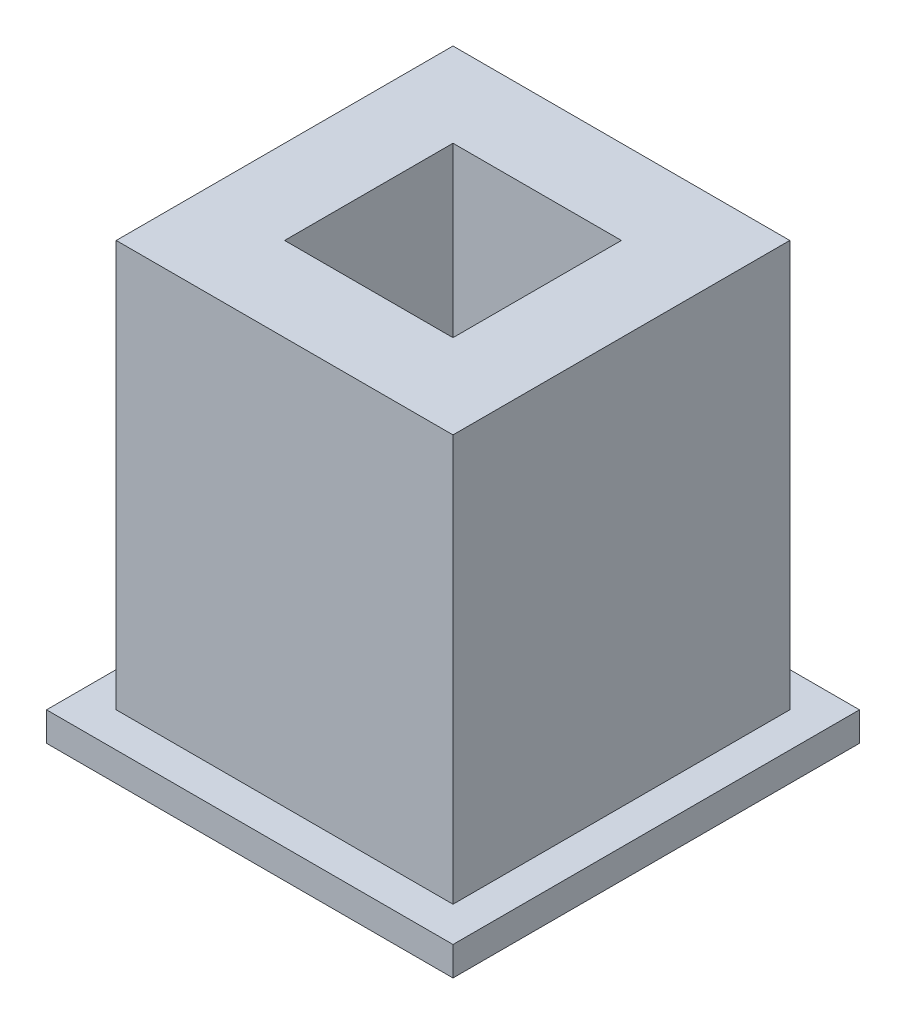
ISO-10303-21;
HEADER;
FILE_DESCRIPTION(('STEP AP214'),'2;1');
FILE_NAME('part.step','',(''),(''),'','','');
FILE_SCHEMA(('AUTOMOTIVE_DESIGN { 1 0 10303 214 1 1 1 1 }'));
ENDSEC;
DATA;
#1=APPLICATION_CONTEXT('core data for automotive mechanical design processes');
#2=APPLICATION_PROTOCOL_DEFINITION('international standard','automotive_design',2000,#1);
#3=PRODUCT_CONTEXT('',#1,'mechanical');
#4=PRODUCT('Part','Part','',(#3));
#5=PRODUCT_RELATED_PRODUCT_CATEGORY('part','',(#4));
#6=PRODUCT_DEFINITION_FORMATION('','',#4);
#7=PRODUCT_DEFINITION_CONTEXT('part definition',#1,'design');
#8=PRODUCT_DEFINITION('design','',#6,#7);
#9=PRODUCT_DEFINITION_SHAPE('','',#8);
#10=(LENGTH_UNIT() NAMED_UNIT(*) SI_UNIT(.MILLI.,.METRE.));
#11=(NAMED_UNIT(*) PLANE_ANGLE_UNIT() SI_UNIT($,.RADIAN.));
#12=(NAMED_UNIT(*) SI_UNIT($,.STERADIAN.) SOLID_ANGLE_UNIT());
#13=UNCERTAINTY_MEASURE_WITH_UNIT(LENGTH_MEASURE(1.E-05),#10,'distance_accuracy_value','');
#14=(GEOMETRIC_REPRESENTATION_CONTEXT(3) GLOBAL_UNCERTAINTY_ASSIGNED_CONTEXT((#13)) GLOBAL_UNIT_ASSIGNED_CONTEXT((#10,
#11,#12)) REPRESENTATION_CONTEXT('',''));
#15=CARTESIAN_POINT('',(0.,0.,0.));
#16=DIRECTION('',(0.,0.,1.));
#17=DIRECTION('',(1.,0.,0.));
#18=AXIS2_PLACEMENT_3D('',#15,#16,#17);
#19=CARTESIAN_POINT('',(0.,7.,0.));
#20=DIRECTION('',(1.,0.,0.));
#21=DIRECTION('',(0.,0.,-1.));
#22=AXIS2_PLACEMENT_3D('',#19,#20,#21);
#23=PLANE('',#22);
#24=DIRECTION('',(0.,0.,1.));
#25=VECTOR('',#24,1.);
#26=CARTESIAN_POINT('',(0.,0.,0.));
#27=LINE('',#26,#25);
#28=CARTESIAN_POINT('',(0.,0.,-5.8));
#29=VERTEX_POINT('',#28);
#30=CARTESIAN_POINT('',(0.,0.,0.));
#31=VERTEX_POINT('',#30);
#32=EDGE_CURVE('E230',#29,#31,#27,.T.);
#33=ORIENTED_EDGE('',*,*,#32,.T.);
#34=DIRECTION('',(0.,-1.,0.));
#35=VECTOR('',#34,1.);
#36=CARTESIAN_POINT('',(0.,7.,0.));
#37=LINE('',#36,#35);
#38=CARTESIAN_POINT('',(0.,7.,0.));
#39=VERTEX_POINT('',#38);
#40=EDGE_CURVE('E280',#39,#31,#37,.T.);
#41=ORIENTED_EDGE('',*,*,#40,.F.);
#42=DIRECTION('',(0.,0.,1.));
#43=VECTOR('',#42,1.);
#44=CARTESIAN_POINT('',(0.,7.,0.));
#45=LINE('',#44,#43);
#46=CARTESIAN_POINT('',(0.,7.,-5.8));
#47=VERTEX_POINT('',#46);
#48=EDGE_CURVE('E240',#47,#39,#45,.T.);
#49=ORIENTED_EDGE('',*,*,#48,.F.);
#50=DIRECTION('',(0.,-1.,0.));
#51=VECTOR('',#50,1.);
#52=CARTESIAN_POINT('',(0.,7.,-5.8));
#53=LINE('',#52,#51);
#54=EDGE_CURVE('E254',#47,#29,#53,.T.);
#55=ORIENTED_EDGE('',*,*,#54,.T.);
#56=EDGE_LOOP('',(#33,#41,#49,#55));
#57=FACE_BOUND('',#56,.T.);
#58=ADVANCED_FACE('F47',(#57),#23,.F.);
#59=CARTESIAN_POINT('',(0.,7.,0.));
#60=DIRECTION('',(0.,0.,-1.));
#61=DIRECTION('',(-1.,0.,0.));
#62=AXIS2_PLACEMENT_3D('',#59,#60,#61);
#63=PLANE('',#62);
#64=DIRECTION('',(1.,0.,0.));
#65=VECTOR('',#64,1.);
#66=CARTESIAN_POINT('',(0.,0.,0.));
#67=LINE('',#66,#65);
#68=CARTESIAN_POINT('',(5.8,0.,0.));
#69=VERTEX_POINT('',#68);
#70=EDGE_CURVE('E258',#31,#69,#67,.T.);
#71=ORIENTED_EDGE('',*,*,#70,.T.);
#72=DIRECTION('',(0.,-1.,0.));
#73=VECTOR('',#72,1.);
#74=CARTESIAN_POINT('',(5.8,7.,0.));
#75=LINE('',#74,#73);
#76=CARTESIAN_POINT('',(5.8,7.,0.));
#77=VERTEX_POINT('',#76);
#78=EDGE_CURVE('E276',#77,#69,#75,.T.);
#79=ORIENTED_EDGE('',*,*,#78,.F.);
#80=DIRECTION('',(1.,0.,0.));
#81=VECTOR('',#80,1.);
#82=CARTESIAN_POINT('',(0.,7.,0.));
#83=LINE('',#82,#81);
#84=EDGE_CURVE('E244',#39,#77,#83,.T.);
#85=ORIENTED_EDGE('',*,*,#84,.F.);
#86=ORIENTED_EDGE('',*,*,#40,.T.);
#87=EDGE_LOOP('',(#71,#79,#85,#86));
#88=FACE_BOUND('',#87,.T.);
#89=ADVANCED_FACE('F338',(#88),#63,.F.);
#90=CARTESIAN_POINT('',(5.8,7.,0.));
#91=DIRECTION('',(-1.,0.,0.));
#92=DIRECTION('',(0.,0.,1.));
#93=AXIS2_PLACEMENT_3D('',#90,#91,#92);
#94=PLANE('',#93);
#95=DIRECTION('',(0.,0.,-1.));
#96=VECTOR('',#95,1.);
#97=CARTESIAN_POINT('',(5.8,0.,0.));
#98=LINE('',#97,#96);
#99=CARTESIAN_POINT('',(5.8,0.,-5.8));
#100=VERTEX_POINT('',#99);
#101=EDGE_CURVE('E262',#69,#100,#98,.T.);
#102=ORIENTED_EDGE('',*,*,#101,.T.);
#103=DIRECTION('',(0.,-1.,0.));
#104=VECTOR('',#103,1.);
#105=CARTESIAN_POINT('',(5.8,7.,-5.8));
#106=LINE('',#105,#104);
#107=CARTESIAN_POINT('',(5.8,7.,-5.8));
#108=VERTEX_POINT('',#107);
#109=EDGE_CURVE('E272',#108,#100,#106,.T.);
#110=ORIENTED_EDGE('',*,*,#109,.F.);
#111=DIRECTION('',(0.,0.,-1.));
#112=VECTOR('',#111,1.);
#113=CARTESIAN_POINT('',(5.8,7.,0.));
#114=LINE('',#113,#112);
#115=EDGE_CURVE('E248',#77,#108,#114,.T.);
#116=ORIENTED_EDGE('',*,*,#115,.F.);
#117=ORIENTED_EDGE('',*,*,#78,.T.);
#118=EDGE_LOOP('',(#102,#110,#116,#117));
#119=FACE_BOUND('',#118,.T.);
#120=ADVANCED_FACE('F345',(#119),#94,.F.);
#121=CARTESIAN_POINT('',(0.,7.,-5.8));
#122=DIRECTION('',(0.,0.,1.));
#123=DIRECTION('',(1.,0.,0.));
#124=AXIS2_PLACEMENT_3D('',#121,#122,#123);
#125=PLANE('',#124);
#126=DIRECTION('',(-1.,0.,0.));
#127=VECTOR('',#126,1.);
#128=CARTESIAN_POINT('',(0.,0.,-5.8));
#129=LINE('',#128,#127);
#130=EDGE_CURVE('E245',#100,#29,#129,.T.);
#131=ORIENTED_EDGE('',*,*,#130,.T.);
#132=ORIENTED_EDGE('',*,*,#54,.F.);
#133=DIRECTION('',(-1.,0.,0.));
#134=VECTOR('',#133,1.);
#135=CARTESIAN_POINT('',(0.,7.,-5.8));
#136=LINE('',#135,#134);
#137=EDGE_CURVE('E251',#108,#47,#136,.T.);
#138=ORIENTED_EDGE('',*,*,#137,.F.);
#139=ORIENTED_EDGE('',*,*,#109,.T.);
#140=EDGE_LOOP('',(#131,#132,#138,#139));
#141=FACE_BOUND('',#140,.T.);
#142=ADVANCED_FACE('F382',(#141),#125,.F.);
#143=CARTESIAN_POINT('',(0.,7.,0.));
#144=DIRECTION('',(0.,-1.,0.));
#145=DIRECTION('',(0.,0.,-1.));
#146=AXIS2_PLACEMENT_3D('',#143,#144,#145);
#147=PLANE('',#146);
#148=DIRECTION('',(1.,0.,0.));
#149=VECTOR('',#148,1.);
#150=CARTESIAN_POINT('',(1.45,7.,-1.45));
#151=LINE('',#150,#149);
#152=CARTESIAN_POINT('',(1.45,7.,-1.45));
#153=VERTEX_POINT('',#152);
#154=CARTESIAN_POINT('',(4.35,7.,-1.45));
#155=VERTEX_POINT('',#154);
#156=EDGE_CURVE('E216',#153,#155,#151,.T.);
#157=ORIENTED_EDGE('',*,*,#156,.F.);
#158=DIRECTION('',(0.,0.,1.));
#159=VECTOR('',#158,1.);
#160=CARTESIAN_POINT('',(1.45,7.,-4.35));
#161=LINE('',#160,#159);
#162=CARTESIAN_POINT('',(1.45,7.,-4.35));
#163=VERTEX_POINT('',#162);
#164=EDGE_CURVE('E162',#163,#153,#161,.T.);
#165=ORIENTED_EDGE('',*,*,#164,.F.);
#166=DIRECTION('',(-1.,0.,0.));
#167=VECTOR('',#166,1.);
#168=CARTESIAN_POINT('',(1.45,7.,-4.35));
#169=LINE('',#168,#167);
#170=CARTESIAN_POINT('',(4.35,7.,-4.35));
#171=VERTEX_POINT('',#170);
#172=EDGE_CURVE('E201',#171,#163,#169,.T.);
#173=ORIENTED_EDGE('',*,*,#172,.F.);
#174=DIRECTION('',(0.,0.,-1.));
#175=VECTOR('',#174,1.);
#176=CARTESIAN_POINT('',(4.35,7.,-4.35));
#177=LINE('',#176,#175);
#178=EDGE_CURVE('E220',#155,#171,#177,.T.);
#179=ORIENTED_EDGE('',*,*,#178,.F.);
#180=EDGE_LOOP('',(#157,#165,#173,#179));
#181=FACE_BOUND('',#180,.T.);
#182=ORIENTED_EDGE('',*,*,#48,.T.);
#183=ORIENTED_EDGE('',*,*,#84,.T.);
#184=ORIENTED_EDGE('',*,*,#115,.T.);
#185=ORIENTED_EDGE('',*,*,#137,.T.);
#186=EDGE_LOOP('',(#182,#183,#184,#185));
#187=FACE_BOUND('',#186,.T.);
#188=ADVANCED_FACE('F387',(#181,#187),#147,.F.);
#189=CARTESIAN_POINT('',(1.45,3.2,-4.35));
#190=DIRECTION('',(-1.,0.,0.));
#191=DIRECTION('',(0.,0.,1.));
#192=AXIS2_PLACEMENT_3D('',#189,#190,#191);
#193=PLANE('',#192);
#194=ORIENTED_EDGE('',*,*,#164,.T.);
#195=DIRECTION('',(0.,1.,0.));
#196=VECTOR('',#195,1.);
#197=CARTESIAN_POINT('',(1.45,3.2,-1.45));
#198=LINE('',#197,#196);
#199=CARTESIAN_POINT('',(1.45,3.2,-1.45));
#200=VERTEX_POINT('',#199);
#201=EDGE_CURVE('E213',#200,#153,#198,.T.);
#202=ORIENTED_EDGE('',*,*,#201,.F.);
#203=DIRECTION('',(0.,0.,1.));
#204=VECTOR('',#203,1.);
#205=CARTESIAN_POINT('',(1.45,3.2,-4.35));
#206=LINE('',#205,#204);
#207=CARTESIAN_POINT('',(1.45,3.2,-4.35));
#208=VERTEX_POINT('',#207);
#209=EDGE_CURVE('E196',#208,#200,#206,.T.);
#210=ORIENTED_EDGE('',*,*,#209,.F.);
#211=DIRECTION('',(0.,1.,0.));
#212=VECTOR('',#211,1.);
#213=CARTESIAN_POINT('',(1.45,3.2,-4.35));
#214=LINE('',#213,#212);
#215=EDGE_CURVE('E227',#208,#163,#214,.T.);
#216=ORIENTED_EDGE('',*,*,#215,.T.);
#217=EDGE_LOOP('',(#194,#202,#210,#216));
#218=FACE_BOUND('',#217,.T.);
#219=ADVANCED_FACE('F398',(#218),#193,.F.);
#220=CARTESIAN_POINT('',(1.45,3.2,-4.35));
#221=DIRECTION('',(0.,0.,-1.));
#222=DIRECTION('',(-1.,0.,0.));
#223=AXIS2_PLACEMENT_3D('',#220,#221,#222);
#224=PLANE('',#223);
#225=ORIENTED_EDGE('',*,*,#172,.T.);
#226=ORIENTED_EDGE('',*,*,#215,.F.);
#227=DIRECTION('',(-1.,0.,0.));
#228=VECTOR('',#227,1.);
#229=CARTESIAN_POINT('',(1.45,3.2,-4.35));
#230=LINE('',#229,#228);
#231=CARTESIAN_POINT('',(4.35,3.2,-4.35));
#232=VERTEX_POINT('',#231);
#233=EDGE_CURVE('E209',#232,#208,#230,.T.);
#234=ORIENTED_EDGE('',*,*,#233,.F.);
#235=DIRECTION('',(0.,1.,0.));
#236=VECTOR('',#235,1.);
#237=CARTESIAN_POINT('',(4.35,3.2,-4.35));
#238=LINE('',#237,#236);
#239=EDGE_CURVE('E231',#232,#171,#238,.T.);
#240=ORIENTED_EDGE('',*,*,#239,.T.);
#241=EDGE_LOOP('',(#225,#226,#234,#240));
#242=FACE_BOUND('',#241,.T.);
#243=ADVANCED_FACE('F402',(#242),#224,.F.);
#244=CARTESIAN_POINT('',(4.35,3.2,-4.35));
#245=DIRECTION('',(1.,0.,0.));
#246=DIRECTION('',(0.,0.,-1.));
#247=AXIS2_PLACEMENT_3D('',#244,#245,#246);
#248=PLANE('',#247);
#249=ORIENTED_EDGE('',*,*,#178,.T.);
#250=ORIENTED_EDGE('',*,*,#239,.F.);
#251=DIRECTION('',(0.,0.,-1.));
#252=VECTOR('',#251,1.);
#253=CARTESIAN_POINT('',(4.35,3.2,-4.35));
#254=LINE('',#253,#252);
#255=CARTESIAN_POINT('',(4.35,3.2,-1.45));
#256=VERTEX_POINT('',#255);
#257=EDGE_CURVE('E205',#256,#232,#254,.T.);
#258=ORIENTED_EDGE('',*,*,#257,.F.);
#259=DIRECTION('',(0.,1.,0.));
#260=VECTOR('',#259,1.);
#261=CARTESIAN_POINT('',(4.35,3.2,-1.45));
#262=LINE('',#261,#260);
#263=EDGE_CURVE('E234',#256,#155,#262,.T.);
#264=ORIENTED_EDGE('',*,*,#263,.T.);
#265=EDGE_LOOP('',(#249,#250,#258,#264));
#266=FACE_BOUND('',#265,.T.);
#267=ADVANCED_FACE('F408',(#266),#248,.F.);
#268=CARTESIAN_POINT('',(1.45,3.2,-1.45));
#269=DIRECTION('',(0.,0.,1.));
#270=DIRECTION('',(1.,0.,0.));
#271=AXIS2_PLACEMENT_3D('',#268,#269,#270);
#272=PLANE('',#271);
#273=ORIENTED_EDGE('',*,*,#156,.T.);
#274=ORIENTED_EDGE('',*,*,#263,.F.);
#275=DIRECTION('',(1.,0.,0.));
#276=VECTOR('',#275,1.);
#277=CARTESIAN_POINT('',(1.45,3.2,-1.45));
#278=LINE('',#277,#276);
#279=EDGE_CURVE('E200',#200,#256,#278,.T.);
#280=ORIENTED_EDGE('',*,*,#279,.F.);
#281=ORIENTED_EDGE('',*,*,#201,.T.);
#282=EDGE_LOOP('',(#273,#274,#280,#281));
#283=FACE_BOUND('',#282,.T.);
#284=ADVANCED_FACE('F404',(#283),#272,.F.);
#285=CARTESIAN_POINT('',(0.,3.2,0.));
#286=DIRECTION('',(0.,1.,0.));
#287=DIRECTION('',(0.,0.,1.));
#288=AXIS2_PLACEMENT_3D('',#285,#286,#287);
#289=PLANE('',#288);
#290=ORIENTED_EDGE('',*,*,#209,.T.);
#291=ORIENTED_EDGE('',*,*,#279,.T.);
#292=ORIENTED_EDGE('',*,*,#257,.T.);
#293=ORIENTED_EDGE('',*,*,#233,.T.);
#294=EDGE_LOOP('',(#290,#291,#292,#293));
#295=FACE_BOUND('',#294,.T.);
#296=ADVANCED_FACE('F407',(#295),#289,.T.);
#297=CARTESIAN_POINT('',(-0.6,-1.7,0.6));
#298=DIRECTION('',(1.,0.,0.));
#299=DIRECTION('',(0.,0.,-1.));
#300=AXIS2_PLACEMENT_3D('',#297,#298,#299);
#301=PLANE('',#300);
#302=DIRECTION('',(0.,1.,0.));
#303=VECTOR('',#302,1.);
#304=CARTESIAN_POINT('',(-0.6,-1.7,-6.4));
#305=LINE('',#304,#303);
#306=CARTESIAN_POINT('',(-0.6,-0.499999999999997,-6.4));
#307=VERTEX_POINT('',#306);
#308=CARTESIAN_POINT('',(-0.6,0.,-6.4));
#309=VERTEX_POINT('',#308);
#310=EDGE_CURVE('E151',#307,#309,#305,.T.);
#311=ORIENTED_EDGE('',*,*,#310,.F.);
#312=DIRECTION('',(0.,0.,1.));
#313=VECTOR('',#312,1.);
#314=CARTESIAN_POINT('',(-0.6,-0.499999999999997,0.6));
#315=LINE('',#314,#313);
#316=CARTESIAN_POINT('',(-0.6,-0.499999999999997,0.6));
#317=VERTEX_POINT('',#316);
#318=EDGE_CURVE('E297',#307,#317,#315,.T.);
#319=ORIENTED_EDGE('',*,*,#318,.T.);
#320=DIRECTION('',(0.,1.,0.));
#321=VECTOR('',#320,1.);
#322=CARTESIAN_POINT('',(-0.6,-1.7,0.6));
#323=LINE('',#322,#321);
#324=CARTESIAN_POINT('',(-0.6,0.,0.6));
#325=VERTEX_POINT('',#324);
#326=EDGE_CURVE('E175',#317,#325,#323,.T.);
#327=ORIENTED_EDGE('',*,*,#326,.T.);
#328=DIRECTION('',(0.,0.,-1.));
#329=VECTOR('',#328,1.);
#330=CARTESIAN_POINT('',(-0.6,0.,0.6));
#331=LINE('',#330,#329);
#332=EDGE_CURVE('E169',#325,#309,#331,.T.);
#333=ORIENTED_EDGE('',*,*,#332,.T.);
#334=EDGE_LOOP('',(#311,#319,#327,#333));
#335=FACE_BOUND('',#334,.T.);
#336=ADVANCED_FACE('F174',(#335),#301,.F.);
#337=CARTESIAN_POINT('',(-0.6,-1.7,-6.4));
#338=DIRECTION('',(0.,0.,1.));
#339=DIRECTION('',(1.,0.,0.));
#340=AXIS2_PLACEMENT_3D('',#337,#338,#339);
#341=PLANE('',#340);
#342=DIRECTION('',(0.,1.,0.));
#343=VECTOR('',#342,1.);
#344=CARTESIAN_POINT('',(6.4,-1.7,-6.4));
#345=LINE('',#344,#343);
#346=CARTESIAN_POINT('',(6.4,-0.499999999999997,-6.4));
#347=VERTEX_POINT('',#346);
#348=CARTESIAN_POINT('',(6.4,0.,-6.4));
#349=VERTEX_POINT('',#348);
#350=EDGE_CURVE('E163',#347,#349,#345,.T.);
#351=ORIENTED_EDGE('',*,*,#350,.F.);
#352=DIRECTION('',(-1.,0.,0.));
#353=VECTOR('',#352,1.);
#354=CARTESIAN_POINT('',(-0.6,-0.499999999999997,-6.4));
#355=LINE('',#354,#353);
#356=EDGE_CURVE('E11',#347,#307,#355,.T.);
#357=ORIENTED_EDGE('',*,*,#356,.T.);
#358=ORIENTED_EDGE('',*,*,#310,.T.);
#359=DIRECTION('',(1.,0.,0.));
#360=VECTOR('',#359,1.);
#361=CARTESIAN_POINT('',(-0.6,0.,-6.4));
#362=LINE('',#361,#360);
#363=EDGE_CURVE('E154',#309,#349,#362,.T.);
#364=ORIENTED_EDGE('',*,*,#363,.T.);
#365=EDGE_LOOP('',(#351,#357,#358,#364));
#366=FACE_BOUND('',#365,.T.);
#367=ADVANCED_FACE('F153',(#366),#341,.F.);
#368=CARTESIAN_POINT('',(6.4,-1.7,0.6));
#369=DIRECTION('',(-1.,0.,0.));
#370=DIRECTION('',(0.,0.,1.));
#371=AXIS2_PLACEMENT_3D('',#368,#369,#370);
#372=PLANE('',#371);
#373=DIRECTION('',(0.,1.,0.));
#374=VECTOR('',#373,1.);
#375=CARTESIAN_POINT('',(6.4,-1.7,0.6));
#376=LINE('',#375,#374);
#377=CARTESIAN_POINT('',(6.4,-0.499999999999997,0.6));
#378=VERTEX_POINT('',#377);
#379=CARTESIAN_POINT('',(6.4,0.,0.6));
#380=VERTEX_POINT('',#379);
#381=EDGE_CURVE('E191',#378,#380,#376,.T.);
#382=ORIENTED_EDGE('',*,*,#381,.F.);
#383=DIRECTION('',(0.,0.,-1.));
#384=VECTOR('',#383,1.);
#385=CARTESIAN_POINT('',(6.4,-0.499999999999997,-6.4));
#386=LINE('',#385,#384);
#387=EDGE_CURVE('E58',#378,#347,#386,.T.);
#388=ORIENTED_EDGE('',*,*,#387,.T.);
#389=ORIENTED_EDGE('',*,*,#350,.T.);
#390=DIRECTION('',(0.,0.,1.));
#391=VECTOR('',#390,1.);
#392=CARTESIAN_POINT('',(6.4,0.,0.6));
#393=LINE('',#392,#391);
#394=EDGE_CURVE('E171',#349,#380,#393,.T.);
#395=ORIENTED_EDGE('',*,*,#394,.T.);
#396=EDGE_LOOP('',(#382,#388,#389,#395));
#397=FACE_BOUND('',#396,.T.);
#398=ADVANCED_FACE('F328',(#397),#372,.F.);
#399=CARTESIAN_POINT('',(-0.6,-1.7,0.6));
#400=DIRECTION('',(0.,0.,-1.));
#401=DIRECTION('',(-1.,0.,0.));
#402=AXIS2_PLACEMENT_3D('',#399,#400,#401);
#403=PLANE('',#402);
#404=ORIENTED_EDGE('',*,*,#326,.F.);
#405=DIRECTION('',(1.,0.,0.));
#406=VECTOR('',#405,1.);
#407=CARTESIAN_POINT('',(6.4,-0.499999999999997,0.6));
#408=LINE('',#407,#406);
#409=EDGE_CURVE('E73',#317,#378,#408,.T.);
#410=ORIENTED_EDGE('',*,*,#409,.T.);
#411=ORIENTED_EDGE('',*,*,#381,.T.);
#412=DIRECTION('',(-1.,0.,0.));
#413=VECTOR('',#412,1.);
#414=CARTESIAN_POINT('',(-0.6,0.,0.6));
#415=LINE('',#414,#413);
#416=EDGE_CURVE('E186',#380,#325,#415,.T.);
#417=ORIENTED_EDGE('',*,*,#416,.T.);
#418=EDGE_LOOP('',(#404,#410,#411,#417));
#419=FACE_BOUND('',#418,.T.);
#420=ADVANCED_FACE('F327',(#419),#403,.F.);
#421=CARTESIAN_POINT('',(0.,-1.7,0.));
#422=DIRECTION('',(0.,-1.,0.));
#423=DIRECTION('',(0.,0.,-1.));
#424=AXIS2_PLACEMENT_3D('',#421,#422,#423);
#425=PLANE('',#424);
#426=DIRECTION('',(-1.,0.,0.));
#427=VECTOR('',#426,1.);
#428=CARTESIAN_POINT('',(-0.6,-1.7,-0.599999999999998));
#429=LINE('',#428,#427);
#430=CARTESIAN_POINT('',(5.2,-1.7,-0.599999999999998));
#431=VERTEX_POINT('',#430);
#432=CARTESIAN_POINT('',(0.599999999999998,-1.7,-0.599999999999998));
#433=VERTEX_POINT('',#432);
#434=EDGE_CURVE('E290',#431,#433,#429,.T.);
#435=ORIENTED_EDGE('',*,*,#434,.T.);
#436=DIRECTION('',(0.,0.,-1.));
#437=VECTOR('',#436,1.);
#438=CARTESIAN_POINT('',(0.599999999999998,-1.7,-6.4));
#439=LINE('',#438,#437);
#440=CARTESIAN_POINT('',(0.599999999999998,-1.7,-5.2));
#441=VERTEX_POINT('',#440);
#442=EDGE_CURVE('E293',#433,#441,#439,.T.);
#443=ORIENTED_EDGE('',*,*,#442,.T.);
#444=DIRECTION('',(1.,0.,0.));
#445=VECTOR('',#444,1.);
#446=CARTESIAN_POINT('',(6.4,-1.7,-5.2));
#447=LINE('',#446,#445);
#448=CARTESIAN_POINT('',(5.2,-1.7,-5.2));
#449=VERTEX_POINT('',#448);
#450=EDGE_CURVE('E284',#441,#449,#447,.T.);
#451=ORIENTED_EDGE('',*,*,#450,.T.);
#452=DIRECTION('',(0.,0.,1.));
#453=VECTOR('',#452,1.);
#454=CARTESIAN_POINT('',(5.2,-1.7,0.6));
#455=LINE('',#454,#453);
#456=EDGE_CURVE('E287',#449,#431,#455,.T.);
#457=ORIENTED_EDGE('',*,*,#456,.T.);
#458=EDGE_LOOP('',(#435,#443,#451,#457));
#459=FACE_BOUND('',#458,.T.);
#460=ADVANCED_FACE('F322',(#459),#425,.T.);
#461=CARTESIAN_POINT('',(0.,0.,0.));
#462=DIRECTION('',(0.,-1.,0.));
#463=DIRECTION('',(0.,0.,-1.));
#464=AXIS2_PLACEMENT_3D('',#461,#462,#463);
#465=PLANE('',#464);
#466=ORIENTED_EDGE('',*,*,#32,.F.);
#467=ORIENTED_EDGE('',*,*,#130,.F.);
#468=ORIENTED_EDGE('',*,*,#101,.F.);
#469=ORIENTED_EDGE('',*,*,#70,.F.);
#470=EDGE_LOOP('',(#466,#467,#468,#469));
#471=FACE_BOUND('',#470,.T.);
#472=ORIENTED_EDGE('',*,*,#332,.F.);
#473=ORIENTED_EDGE('',*,*,#416,.F.);
#474=ORIENTED_EDGE('',*,*,#394,.F.);
#475=ORIENTED_EDGE('',*,*,#363,.F.);
#476=EDGE_LOOP('',(#472,#473,#474,#475));
#477=FACE_BOUND('',#476,.T.);
#478=ADVANCED_FACE('F167',(#471,#477),#465,.F.);
#479=CARTESIAN_POINT('',(5.2,-1.7,0.));
#480=DIRECTION('',(0.707106781186549,-0.707106781186546,0.));
#481=DIRECTION('',(0.,0.,-1.));
#482=AXIS2_PLACEMENT_3D('',#479,#480,#481);
#483=PLANE('',#482);
#484=DIRECTION('',(-0.577350269189625,-0.577350269189628,0.577350269189625));
#485=VECTOR('',#484,1.);
#486=CARTESIAN_POINT('',(3.46666666666667,-3.43333333333334,-3.46666666666667));
#487=LINE('',#486,#485);
#488=EDGE_CURVE('E182',#347,#449,#487,.T.);
#489=ORIENTED_EDGE('',*,*,#488,.F.);
#490=ORIENTED_EDGE('',*,*,#387,.F.);
#491=DIRECTION('',(-0.577350269189625,-0.577350269189628,-0.577350269189625));
#492=VECTOR('',#491,1.);
#493=CARTESIAN_POINT('',(5.4,-1.5,-0.399999999999999));
#494=LINE('',#493,#492);
#495=EDGE_CURVE('E52',#431,#378,#494,.F.);
#496=ORIENTED_EDGE('',*,*,#495,.F.);
#497=ORIENTED_EDGE('',*,*,#456,.F.);
#498=EDGE_LOOP('',(#489,#490,#496,#497));
#499=FACE_BOUND('',#498,.T.);
#500=ADVANCED_FACE('F50',(#499),#483,.T.);
#501=CARTESIAN_POINT('',(0.,-1.7,-0.599999999999998));
#502=DIRECTION('',(0.,-0.707106781186546,0.707106781186549));
#503=DIRECTION('',(1.,0.,0.));
#504=AXIS2_PLACEMENT_3D('',#501,#502,#503);
#505=PLANE('',#504);
#506=ORIENTED_EDGE('',*,*,#495,.T.);
#507=ORIENTED_EDGE('',*,*,#409,.F.);
#508=DIRECTION('',(0.577350269189625,-0.577350269189627,-0.577350269189625));
#509=VECTOR('',#508,1.);
#510=CARTESIAN_POINT('',(0.399999999999999,-1.5,-0.399999999999999));
#511=LINE('',#510,#509);
#512=EDGE_CURVE('E307',#433,#317,#511,.F.);
#513=ORIENTED_EDGE('',*,*,#512,.F.);
#514=ORIENTED_EDGE('',*,*,#434,.F.);
#515=EDGE_LOOP('',(#506,#507,#513,#514));
#516=FACE_BOUND('',#515,.T.);
#517=ADVANCED_FACE('F360',(#516),#505,.T.);
#518=CARTESIAN_POINT('',(0.,-1.7,-5.2));
#519=DIRECTION('',(0.,-0.707106781186546,-0.707106781186549));
#520=DIRECTION('',(-1.,0.,0.));
#521=AXIS2_PLACEMENT_3D('',#518,#519,#520);
#522=PLANE('',#521);
#523=ORIENTED_EDGE('',*,*,#488,.T.);
#524=ORIENTED_EDGE('',*,*,#450,.F.);
#525=DIRECTION('',(-0.577350269189625,0.577350269189628,-0.577350269189625));
#526=VECTOR('',#525,1.);
#527=CARTESIAN_POINT('',(0.399999999999999,-1.5,-5.4));
#528=LINE('',#527,#526);
#529=EDGE_CURVE('E304',#307,#441,#528,.F.);
#530=ORIENTED_EDGE('',*,*,#529,.F.);
#531=ORIENTED_EDGE('',*,*,#356,.F.);
#532=EDGE_LOOP('',(#523,#524,#530,#531));
#533=FACE_BOUND('',#532,.T.);
#534=ADVANCED_FACE('F315',(#533),#522,.T.);
#535=CARTESIAN_POINT('',(0.599999999999998,-1.7,0.));
#536=DIRECTION('',(-0.707106781186549,-0.707106781186546,0.));
#537=DIRECTION('',(0.,0.,1.));
#538=AXIS2_PLACEMENT_3D('',#535,#536,#537);
#539=PLANE('',#538);
#540=ORIENTED_EDGE('',*,*,#512,.T.);
#541=ORIENTED_EDGE('',*,*,#318,.F.);
#542=ORIENTED_EDGE('',*,*,#529,.T.);
#543=ORIENTED_EDGE('',*,*,#442,.F.);
#544=EDGE_LOOP('',(#540,#541,#542,#543));
#545=FACE_BOUND('',#544,.T.);
#546=ADVANCED_FACE('F326',(#545),#539,.T.);
#547=CLOSED_SHELL('',(#58,#89,#120,#142,#188,#219,#243,#267,#284,#296,#336,#367,#398,#420,#460,
#478,#500,#517,#534,#546));
#548=MANIFOLD_SOLID_BREP('B2',#547);
#549=ADVANCED_BREP_SHAPE_REPRESENTATION('',(#18,#548),#14);
#550=SHAPE_DEFINITION_REPRESENTATION(#9,#549);
ENDSEC;
END-ISO-10303-21;
